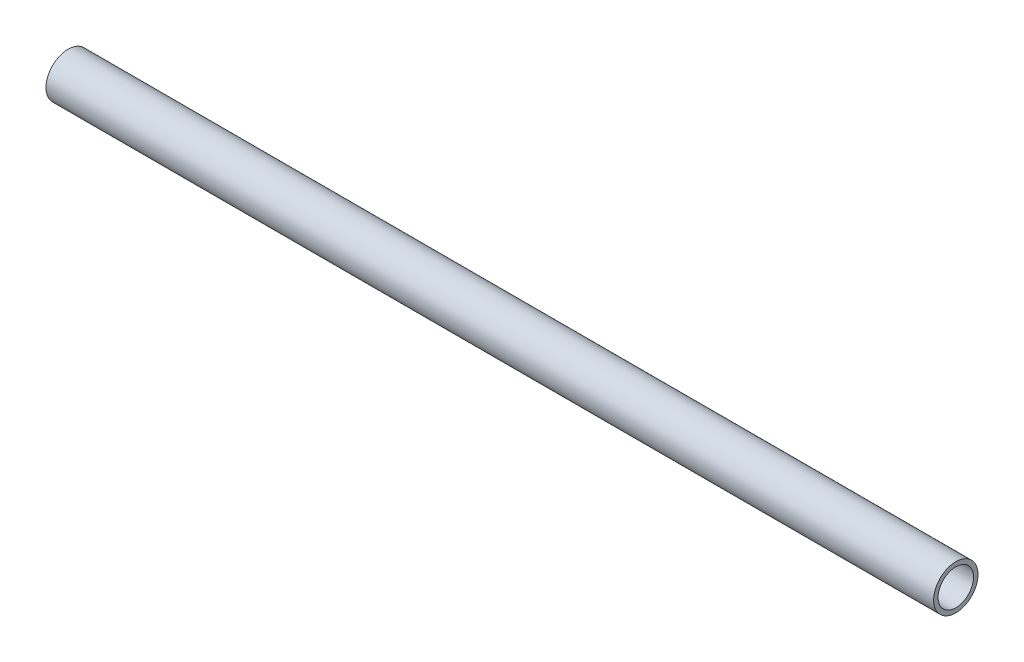
ISO-10303-21;
HEADER;
FILE_DESCRIPTION(('STEP AP214'),'2;1');
FILE_NAME('part.step','',(''),(''),'','','');
FILE_SCHEMA(('AUTOMOTIVE_DESIGN { 1 0 10303 214 1 1 1 1 }'));
ENDSEC;
DATA;
#1=APPLICATION_CONTEXT('core data for automotive mechanical design processes');
#2=APPLICATION_PROTOCOL_DEFINITION('international standard','automotive_design',2000,#1);
#3=PRODUCT_CONTEXT('',#1,'mechanical');
#4=PRODUCT('Part','Part','',(#3));
#5=PRODUCT_RELATED_PRODUCT_CATEGORY('part','',(#4));
#6=PRODUCT_DEFINITION_FORMATION('','',#4);
#7=PRODUCT_DEFINITION_CONTEXT('part definition',#1,'design');
#8=PRODUCT_DEFINITION('design','',#6,#7);
#9=PRODUCT_DEFINITION_SHAPE('','',#8);
#10=(LENGTH_UNIT() NAMED_UNIT(*) SI_UNIT(.MILLI.,.METRE.));
#11=(NAMED_UNIT(*) PLANE_ANGLE_UNIT() SI_UNIT($,.RADIAN.));
#12=(NAMED_UNIT(*) SI_UNIT($,.STERADIAN.) SOLID_ANGLE_UNIT());
#13=UNCERTAINTY_MEASURE_WITH_UNIT(LENGTH_MEASURE(1.E-05),#10,'distance_accuracy_value','');
#14=(GEOMETRIC_REPRESENTATION_CONTEXT(3) GLOBAL_UNCERTAINTY_ASSIGNED_CONTEXT((#13)) GLOBAL_UNIT_ASSIGNED_CONTEXT((#10,
#11,#12)) REPRESENTATION_CONTEXT('',''));
#15=CARTESIAN_POINT('',(0.,0.,0.));
#16=DIRECTION('',(0.,0.,1.));
#17=DIRECTION('',(1.,0.,0.));
#18=AXIS2_PLACEMENT_3D('',#15,#16,#17);
#19=CARTESIAN_POINT('',(200.,0.,0.));
#20=DIRECTION('',(-1.,0.,0.));
#21=DIRECTION('',(0.,0.,1.));
#22=AXIS2_PLACEMENT_3D('',#19,#20,#21);
#23=CYLINDRICAL_SURFACE('',#22,4.);
#24=CARTESIAN_POINT('',(200.,0.,0.));
#25=DIRECTION('',(1.,0.,0.));
#26=DIRECTION('',(0.,0.,-1.));
#27=AXIS2_PLACEMENT_3D('',#24,#25,#26);
#28=CIRCLE('',#27,4.);
#29=CARTESIAN_POINT('',(200.,0.,-4.));
#30=VERTEX_POINT('',#29);
#31=EDGE_CURVE('E40',#30,#30,#28,.T.);
#32=ORIENTED_EDGE('',*,*,#31,.T.);
#33=EDGE_LOOP('',(#32));
#34=FACE_BOUND('',#33,.T.);
#35=CARTESIAN_POINT('',(0.,0.,0.));
#36=DIRECTION('',(1.,0.,0.));
#37=DIRECTION('',(0.,0.,-1.));
#38=AXIS2_PLACEMENT_3D('',#35,#36,#37);
#39=CIRCLE('',#38,4.);
#40=CARTESIAN_POINT('',(0.,0.,-4.));
#41=VERTEX_POINT('',#40);
#42=EDGE_CURVE('E46',#41,#41,#39,.T.);
#43=ORIENTED_EDGE('',*,*,#42,.F.);
#44=EDGE_LOOP('',(#43));
#45=FACE_BOUND('',#44,.T.);
#46=ADVANCED_FACE('F33',(#34,#45),#23,.F.);
#47=CARTESIAN_POINT('',(200.,0.,0.));
#48=DIRECTION('',(-1.,0.,0.));
#49=DIRECTION('',(0.,0.,1.));
#50=AXIS2_PLACEMENT_3D('',#47,#48,#49);
#51=CYLINDRICAL_SURFACE('',#50,5.);
#52=CARTESIAN_POINT('',(200.,0.,0.));
#53=DIRECTION('',(1.,0.,0.));
#54=DIRECTION('',(0.,0.,-1.));
#55=AXIS2_PLACEMENT_3D('',#52,#53,#54);
#56=CIRCLE('',#55,5.);
#57=CARTESIAN_POINT('',(200.,0.,-5.));
#58=VERTEX_POINT('',#57);
#59=EDGE_CURVE('E10',#58,#58,#56,.T.);
#60=ORIENTED_EDGE('',*,*,#59,.F.);
#61=EDGE_LOOP('',(#60));
#62=FACE_BOUND('',#61,.T.);
#63=CARTESIAN_POINT('',(0.,0.,0.));
#64=DIRECTION('',(1.,0.,0.));
#65=DIRECTION('',(0.,0.,-1.));
#66=AXIS2_PLACEMENT_3D('',#63,#64,#65);
#67=CIRCLE('',#66,5.);
#68=CARTESIAN_POINT('',(0.,0.,-5.));
#69=VERTEX_POINT('',#68);
#70=EDGE_CURVE('E36',#69,#69,#67,.T.);
#71=ORIENTED_EDGE('',*,*,#70,.T.);
#72=EDGE_LOOP('',(#71));
#73=FACE_BOUND('',#72,.T.);
#74=ADVANCED_FACE('F53',(#62,#73),#51,.T.);
#75=CARTESIAN_POINT('',(200.,0.,0.));
#76=DIRECTION('',(1.,0.,0.));
#77=DIRECTION('',(0.,0.,-1.));
#78=AXIS2_PLACEMENT_3D('',#75,#76,#77);
#79=PLANE('',#78);
#80=ORIENTED_EDGE('',*,*,#31,.F.);
#81=EDGE_LOOP('',(#80));
#82=FACE_BOUND('',#81,.T.);
#83=ORIENTED_EDGE('',*,*,#59,.T.);
#84=EDGE_LOOP('',(#83));
#85=FACE_BOUND('',#84,.T.);
#86=ADVANCED_FACE('F57',(#82,#85),#79,.T.);
#87=CARTESIAN_POINT('',(0.,0.,0.));
#88=DIRECTION('',(1.,0.,0.));
#89=DIRECTION('',(0.,0.,-1.));
#90=AXIS2_PLACEMENT_3D('',#87,#88,#89);
#91=PLANE('',#90);
#92=ORIENTED_EDGE('',*,*,#42,.T.);
#93=EDGE_LOOP('',(#92));
#94=FACE_BOUND('',#93,.T.);
#95=ORIENTED_EDGE('',*,*,#70,.F.);
#96=EDGE_LOOP('',(#95));
#97=FACE_BOUND('',#96,.T.);
#98=ADVANCED_FACE('F55',(#94,#97),#91,.F.);
#99=CLOSED_SHELL('',(#46,#74,#86,#98));
#100=MANIFOLD_SOLID_BREP('B2',#99);
#101=ADVANCED_BREP_SHAPE_REPRESENTATION('',(#18,#100),#14);
#102=SHAPE_DEFINITION_REPRESENTATION(#9,#101);
ENDSEC;
END-ISO-10303-21;
